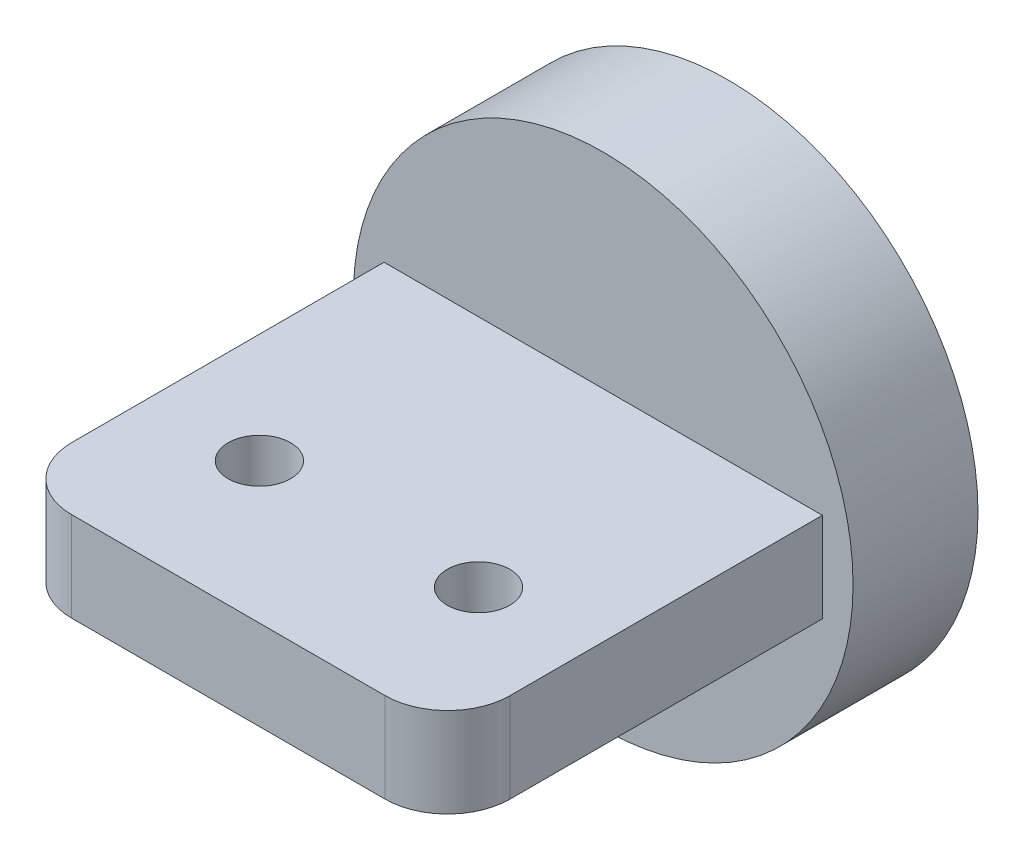
ISO-10303-21;
HEADER;
FILE_DESCRIPTION(('STEP AP214'),'2;1');
FILE_NAME('part.step','',(''),(''),'','','');
FILE_SCHEMA(('AUTOMOTIVE_DESIGN { 1 0 10303 214 1 1 1 1 }'));
ENDSEC;
DATA;
#1=APPLICATION_CONTEXT('core data for automotive mechanical design processes');
#2=APPLICATION_PROTOCOL_DEFINITION('international standard','automotive_design',2000,#1);
#3=PRODUCT_CONTEXT('',#1,'mechanical');
#4=PRODUCT('Part','Part','',(#3));
#5=PRODUCT_RELATED_PRODUCT_CATEGORY('part','',(#4));
#6=PRODUCT_DEFINITION_FORMATION('','',#4);
#7=PRODUCT_DEFINITION_CONTEXT('part definition',#1,'design');
#8=PRODUCT_DEFINITION('design','',#6,#7);
#9=PRODUCT_DEFINITION_SHAPE('','',#8);
#10=(LENGTH_UNIT() NAMED_UNIT(*) SI_UNIT(.MILLI.,.METRE.));
#11=(NAMED_UNIT(*) PLANE_ANGLE_UNIT() SI_UNIT($,.RADIAN.));
#12=(NAMED_UNIT(*) SI_UNIT($,.STERADIAN.) SOLID_ANGLE_UNIT());
#13=UNCERTAINTY_MEASURE_WITH_UNIT(LENGTH_MEASURE(1.E-05),#10,'distance_accuracy_value','');
#14=(GEOMETRIC_REPRESENTATION_CONTEXT(3) GLOBAL_UNCERTAINTY_ASSIGNED_CONTEXT((#13)) GLOBAL_UNIT_ASSIGNED_CONTEXT((#10,
#11,#12)) REPRESENTATION_CONTEXT('',''));
#15=CARTESIAN_POINT('',(0.,0.,0.));
#16=DIRECTION('',(0.,0.,1.));
#17=DIRECTION('',(1.,0.,0.));
#18=AXIS2_PLACEMENT_3D('',#15,#16,#17);
#19=CARTESIAN_POINT('',(0.,0.,10.));
#20=DIRECTION('',(0.,0.,-1.));
#21=DIRECTION('',(-1.,0.,0.));
#22=AXIS2_PLACEMENT_3D('',#19,#20,#21);
#23=CYLINDRICAL_SURFACE('',#22,20.);
#24=CARTESIAN_POINT('',(0.,0.,10.));
#25=DIRECTION('',(0.,0.,1.));
#26=DIRECTION('',(1.,0.,0.));
#27=AXIS2_PLACEMENT_3D('',#24,#25,#26);
#28=CIRCLE('',#27,20.);
#29=CARTESIAN_POINT('',(20.,0.,10.));
#30=VERTEX_POINT('',#29);
#31=EDGE_CURVE('E139',#30,#30,#28,.T.);
#32=ORIENTED_EDGE('',*,*,#31,.F.);
#33=EDGE_LOOP('',(#32));
#34=FACE_BOUND('',#33,.T.);
#35=CARTESIAN_POINT('',(0.,0.,0.));
#36=DIRECTION('',(0.,0.,1.));
#37=DIRECTION('',(1.,0.,0.));
#38=AXIS2_PLACEMENT_3D('',#35,#36,#37);
#39=CIRCLE('',#38,20.);
#40=CARTESIAN_POINT('',(20.,0.,0.));
#41=VERTEX_POINT('',#40);
#42=EDGE_CURVE('E138',#41,#41,#39,.T.);
#43=ORIENTED_EDGE('',*,*,#42,.T.);
#44=EDGE_LOOP('',(#43));
#45=FACE_BOUND('',#44,.T.);
#46=ADVANCED_FACE('F38',(#34,#45),#23,.T.);
#47=CARTESIAN_POINT('',(0.,0.,10.));
#48=DIRECTION('',(0.,0.,1.));
#49=DIRECTION('',(1.,0.,0.));
#50=AXIS2_PLACEMENT_3D('',#47,#48,#49);
#51=PLANE('',#50);
#52=DIRECTION('',(0.,1.,0.));
#53=VECTOR('',#52,1.);
#54=CARTESIAN_POINT('',(17.5413272845998,3.58799876275901,10.));
#55=LINE('',#54,#53);
#56=CARTESIAN_POINT('',(17.5413272845998,-3.58799876275901,10.));
#57=VERTEX_POINT('',#56);
#58=CARTESIAN_POINT('',(17.5413272845998,3.58799876275901,10.));
#59=VERTEX_POINT('',#58);
#60=EDGE_CURVE('E121',#57,#59,#55,.T.);
#61=ORIENTED_EDGE('',*,*,#60,.F.);
#62=DIRECTION('',(1.,0.,0.));
#63=VECTOR('',#62,1.);
#64=CARTESIAN_POINT('',(-17.5413272845998,-3.58799876275901,10.));
#65=LINE('',#64,#63);
#66=CARTESIAN_POINT('',(-17.5413272845998,-3.58799876275901,10.));
#67=VERTEX_POINT('',#66);
#68=EDGE_CURVE('E115',#67,#57,#65,.T.);
#69=ORIENTED_EDGE('',*,*,#68,.F.);
#70=DIRECTION('',(0.,-1.,0.));
#71=VECTOR('',#70,1.);
#72=CARTESIAN_POINT('',(-17.5413272845998,3.58799876275901,10.));
#73=LINE('',#72,#71);
#74=CARTESIAN_POINT('',(-17.5413272845998,3.58799876275901,10.));
#75=VERTEX_POINT('',#74);
#76=EDGE_CURVE('E97',#75,#67,#73,.T.);
#77=ORIENTED_EDGE('',*,*,#76,.F.);
#78=DIRECTION('',(-1.,0.,0.));
#79=VECTOR('',#78,1.);
#80=CARTESIAN_POINT('',(-17.5413272845998,3.58799876275901,10.));
#81=LINE('',#80,#79);
#82=EDGE_CURVE('E112',#59,#75,#81,.T.);
#83=ORIENTED_EDGE('',*,*,#82,.F.);
#84=EDGE_LOOP('',(#61,#69,#77,#83));
#85=FACE_BOUND('',#84,.T.);
#86=ORIENTED_EDGE('',*,*,#31,.T.);
#87=EDGE_LOOP('',(#86));
#88=FACE_BOUND('',#87,.T.);
#89=ADVANCED_FACE('F110',(#85,#88),#51,.T.);
#90=CARTESIAN_POINT('',(0.,0.,0.));
#91=DIRECTION('',(0.,0.,1.));
#92=DIRECTION('',(1.,0.,0.));
#93=AXIS2_PLACEMENT_3D('',#90,#91,#92);
#94=PLANE('',#93);
#95=CARTESIAN_POINT('',(0.,0.,0.));
#96=DIRECTION('',(0.,0.,-1.));
#97=DIRECTION('',(-1.,0.,0.));
#98=AXIS2_PLACEMENT_3D('',#95,#96,#97);
#99=CIRCLE('',#98,10.);
#100=CARTESIAN_POINT('',(-10.,0.,0.));
#101=VERTEX_POINT('',#100);
#102=EDGE_CURVE('E184',#101,#101,#99,.T.);
#103=ORIENTED_EDGE('',*,*,#102,.F.);
#104=EDGE_LOOP('',(#103));
#105=FACE_BOUND('',#104,.T.);
#106=ORIENTED_EDGE('',*,*,#42,.F.);
#107=EDGE_LOOP('',(#106));
#108=FACE_BOUND('',#107,.T.);
#109=ADVANCED_FACE('F216',(#105,#108),#94,.F.);
#110=CARTESIAN_POINT('',(17.5413272845998,3.58799876275901,40.));
#111=DIRECTION('',(-1.,0.,0.));
#112=DIRECTION('',(0.,0.,1.));
#113=AXIS2_PLACEMENT_3D('',#110,#111,#112);
#114=PLANE('',#113);
#115=DIRECTION('',(0.,0.,-1.));
#116=VECTOR('',#115,1.);
#117=CARTESIAN_POINT('',(17.5413272845998,3.58799876275901,40.));
#118=LINE('',#117,#116);
#119=CARTESIAN_POINT('',(17.5413272845998,3.58799876275901,35.));
#120=VERTEX_POINT('',#119);
#121=EDGE_CURVE('E103',#120,#59,#118,.T.);
#122=ORIENTED_EDGE('',*,*,#121,.F.);
#123=DIRECTION('',(0.,1.,0.));
#124=VECTOR('',#123,1.);
#125=CARTESIAN_POINT('',(17.5413272845998,-3.58799876275901,35.));
#126=LINE('',#125,#124);
#127=CARTESIAN_POINT('',(17.5413272845998,-3.58799876275901,35.));
#128=VERTEX_POINT('',#127);
#129=EDGE_CURVE('E64',#120,#128,#126,.F.);
#130=ORIENTED_EDGE('',*,*,#129,.T.);
#131=DIRECTION('',(0.,0.,-1.));
#132=VECTOR('',#131,1.);
#133=CARTESIAN_POINT('',(17.5413272845998,-3.58799876275901,40.));
#134=LINE('',#133,#132);
#135=EDGE_CURVE('E130',#128,#57,#134,.T.);
#136=ORIENTED_EDGE('',*,*,#135,.T.);
#137=ORIENTED_EDGE('',*,*,#60,.T.);
#138=EDGE_LOOP('',(#122,#130,#136,#137));
#139=FACE_BOUND('',#138,.T.);
#140=ADVANCED_FACE('F198',(#139),#114,.F.);
#141=CARTESIAN_POINT('',(-17.5413272845998,3.58799876275901,40.));
#142=DIRECTION('',(0.,-1.,0.));
#143=DIRECTION('',(0.,0.,-1.));
#144=AXIS2_PLACEMENT_3D('',#141,#142,#143);
#145=PLANE('',#144);
#146=CARTESIAN_POINT('',(-8.7706636422999,3.58799876275901,28.75));
#147=DIRECTION('',(0.,1.,0.));
#148=DIRECTION('',(0.,0.,1.));
#149=AXIS2_PLACEMENT_3D('',#146,#147,#148);
#150=CIRCLE('',#149,2.5);
#151=CARTESIAN_POINT('',(-8.7706636422999,3.58799876275901,31.25));
#152=VERTEX_POINT('',#151);
#153=EDGE_CURVE('E168',#152,#152,#150,.T.);
#154=ORIENTED_EDGE('',*,*,#153,.F.);
#155=EDGE_LOOP('',(#154));
#156=FACE_BOUND('',#155,.T.);
#157=CARTESIAN_POINT('',(8.7706636422999,3.58799876275901,28.75));
#158=DIRECTION('',(0.,1.,0.));
#159=DIRECTION('',(0.,0.,-1.));
#160=AXIS2_PLACEMENT_3D('',#157,#158,#159);
#161=CIRCLE('',#160,2.5);
#162=CARTESIAN_POINT('',(8.7706636422999,3.58799876275901,26.25));
#163=VERTEX_POINT('',#162);
#164=EDGE_CURVE('E175',#163,#163,#161,.T.);
#165=ORIENTED_EDGE('',*,*,#164,.F.);
#166=EDGE_LOOP('',(#165));
#167=FACE_BOUND('',#166,.T.);
#168=DIRECTION('',(-1.,0.,0.));
#169=VECTOR('',#168,1.);
#170=CARTESIAN_POINT('',(-17.5413272845998,3.58799876275901,40.));
#171=LINE('',#170,#169);
#172=CARTESIAN_POINT('',(12.5413272845998,3.58799876275901,40.));
#173=VERTEX_POINT('',#172);
#174=CARTESIAN_POINT('',(-12.5413272845998,3.58799876275901,40.));
#175=VERTEX_POINT('',#174);
#176=EDGE_CURVE('E129',#173,#175,#171,.T.);
#177=ORIENTED_EDGE('',*,*,#176,.F.);
#178=CARTESIAN_POINT('',(12.5413272845998,3.58799876275901,35.));
#179=DIRECTION('',(0.,-1.,0.));
#180=DIRECTION('',(0.,0.,-1.));
#181=AXIS2_PLACEMENT_3D('',#178,#179,#180);
#182=CIRCLE('',#181,5.);
#183=EDGE_CURVE('E157',#173,#120,#182,.F.);
#184=ORIENTED_EDGE('',*,*,#183,.T.);
#185=ORIENTED_EDGE('',*,*,#121,.T.);
#186=ORIENTED_EDGE('',*,*,#82,.T.);
#187=DIRECTION('',(0.,0.,-1.));
#188=VECTOR('',#187,1.);
#189=CARTESIAN_POINT('',(-17.5413272845998,3.58799876275901,40.));
#190=LINE('',#189,#188);
#191=CARTESIAN_POINT('',(-17.5413272845998,3.58799876275901,35.));
#192=VERTEX_POINT('',#191);
#193=EDGE_CURVE('E94',#192,#75,#190,.T.);
#194=ORIENTED_EDGE('',*,*,#193,.F.);
#195=CARTESIAN_POINT('',(-12.5413272845998,3.58799876275901,35.));
#196=DIRECTION('',(0.,-1.,0.));
#197=DIRECTION('',(0.,0.,-1.));
#198=AXIS2_PLACEMENT_3D('',#195,#196,#197);
#199=CIRCLE('',#198,5.);
#200=EDGE_CURVE('E154',#192,#175,#199,.F.);
#201=ORIENTED_EDGE('',*,*,#200,.T.);
#202=EDGE_LOOP('',(#177,#184,#185,#186,#194,#201));
#203=FACE_BOUND('',#202,.T.);
#204=ADVANCED_FACE('F119',(#156,#167,#203),#145,.F.);
#205=CARTESIAN_POINT('',(-17.5413272845998,3.58799876275901,40.));
#206=DIRECTION('',(1.,0.,0.));
#207=DIRECTION('',(0.,0.,-1.));
#208=AXIS2_PLACEMENT_3D('',#205,#206,#207);
#209=PLANE('',#208);
#210=DIRECTION('',(0.,0.,-1.));
#211=VECTOR('',#210,1.);
#212=CARTESIAN_POINT('',(-17.5413272845998,-3.58799876275901,40.));
#213=LINE('',#212,#211);
#214=CARTESIAN_POINT('',(-17.5413272845998,-3.58799876275901,35.));
#215=VERTEX_POINT('',#214);
#216=EDGE_CURVE('E104',#215,#67,#213,.T.);
#217=ORIENTED_EDGE('',*,*,#216,.F.);
#218=DIRECTION('',(0.,-1.,0.));
#219=VECTOR('',#218,1.);
#220=CARTESIAN_POINT('',(-17.5413272845998,3.58799876275901,35.));
#221=LINE('',#220,#219);
#222=EDGE_CURVE('E11',#215,#192,#221,.F.);
#223=ORIENTED_EDGE('',*,*,#222,.T.);
#224=ORIENTED_EDGE('',*,*,#193,.T.);
#225=ORIENTED_EDGE('',*,*,#76,.T.);
#226=EDGE_LOOP('',(#217,#223,#224,#225));
#227=FACE_BOUND('',#226,.T.);
#228=ADVANCED_FACE('F96',(#227),#209,.F.);
#229=CARTESIAN_POINT('',(-17.5413272845998,-3.58799876275901,40.));
#230=DIRECTION('',(0.,1.,0.));
#231=DIRECTION('',(0.,0.,1.));
#232=AXIS2_PLACEMENT_3D('',#229,#230,#231);
#233=PLANE('',#232);
#234=CARTESIAN_POINT('',(-8.7706636422999,-3.58799876275901,28.75));
#235=DIRECTION('',(0.,1.,0.));
#236=DIRECTION('',(0.,0.,1.));
#237=AXIS2_PLACEMENT_3D('',#234,#235,#236);
#238=CIRCLE('',#237,2.5);
#239=CARTESIAN_POINT('',(-8.7706636422999,-3.58799876275901,31.25));
#240=VERTEX_POINT('',#239);
#241=EDGE_CURVE('E42',#240,#240,#238,.T.);
#242=ORIENTED_EDGE('',*,*,#241,.T.);
#243=EDGE_LOOP('',(#242));
#244=FACE_BOUND('',#243,.T.);
#245=CARTESIAN_POINT('',(8.7706636422999,-3.58799876275901,28.75));
#246=DIRECTION('',(0.,1.,0.));
#247=DIRECTION('',(0.,0.,1.));
#248=AXIS2_PLACEMENT_3D('',#245,#246,#247);
#249=CIRCLE('',#248,2.5);
#250=CARTESIAN_POINT('',(8.7706636422999,-3.58799876275901,31.25));
#251=VERTEX_POINT('',#250);
#252=EDGE_CURVE('E165',#251,#251,#249,.T.);
#253=ORIENTED_EDGE('',*,*,#252,.T.);
#254=EDGE_LOOP('',(#253));
#255=FACE_BOUND('',#254,.T.);
#256=ORIENTED_EDGE('',*,*,#135,.F.);
#257=CARTESIAN_POINT('',(12.5413272845998,-3.58799876275901,35.));
#258=DIRECTION('',(0.,1.,0.));
#259=DIRECTION('',(0.,0.,1.));
#260=AXIS2_PLACEMENT_3D('',#257,#258,#259);
#261=CIRCLE('',#260,5.);
#262=CARTESIAN_POINT('',(12.5413272845998,-3.58799876275901,40.));
#263=VERTEX_POINT('',#262);
#264=EDGE_CURVE('E48',#128,#263,#261,.F.);
#265=ORIENTED_EDGE('',*,*,#264,.T.);
#266=DIRECTION('',(1.,0.,0.));
#267=VECTOR('',#266,1.);
#268=CARTESIAN_POINT('',(-17.5413272845998,-3.58799876275901,40.));
#269=LINE('',#268,#267);
#270=CARTESIAN_POINT('',(-12.5413272845998,-3.58799876275901,40.));
#271=VERTEX_POINT('',#270);
#272=EDGE_CURVE('E133',#271,#263,#269,.T.);
#273=ORIENTED_EDGE('',*,*,#272,.F.);
#274=CARTESIAN_POINT('',(-12.5413272845998,-3.58799876275901,35.));
#275=DIRECTION('',(0.,1.,0.));
#276=DIRECTION('',(0.,0.,1.));
#277=AXIS2_PLACEMENT_3D('',#274,#275,#276);
#278=CIRCLE('',#277,5.);
#279=EDGE_CURVE('E56',#271,#215,#278,.F.);
#280=ORIENTED_EDGE('',*,*,#279,.T.);
#281=ORIENTED_EDGE('',*,*,#216,.T.);
#282=ORIENTED_EDGE('',*,*,#68,.T.);
#283=EDGE_LOOP('',(#256,#265,#273,#280,#281,#282));
#284=FACE_BOUND('',#283,.T.);
#285=ADVANCED_FACE('F199',(#244,#255,#284),#233,.F.);
#286=CARTESIAN_POINT('',(0.,0.,40.));
#287=DIRECTION('',(0.,0.,1.));
#288=DIRECTION('',(1.,0.,0.));
#289=AXIS2_PLACEMENT_3D('',#286,#287,#288);
#290=PLANE('',#289);
#291=ORIENTED_EDGE('',*,*,#272,.T.);
#292=DIRECTION('',(0.,1.,0.));
#293=VECTOR('',#292,1.);
#294=CARTESIAN_POINT('',(12.5413272845998,3.58799876275901,40.));
#295=LINE('',#294,#293);
#296=EDGE_CURVE('E150',#263,#173,#295,.T.);
#297=ORIENTED_EDGE('',*,*,#296,.T.);
#298=ORIENTED_EDGE('',*,*,#176,.T.);
#299=DIRECTION('',(0.,-1.,0.));
#300=VECTOR('',#299,1.);
#301=CARTESIAN_POINT('',(-12.5413272845998,-3.58799876275901,40.));
#302=LINE('',#301,#300);
#303=EDGE_CURVE('E143',#175,#271,#302,.T.);
#304=ORIENTED_EDGE('',*,*,#303,.T.);
#305=EDGE_LOOP('',(#291,#297,#298,#304));
#306=FACE_BOUND('',#305,.T.);
#307=ADVANCED_FACE('F193',(#306),#290,.T.);
#308=CARTESIAN_POINT('',(12.5413272845998,0.,35.));
#309=DIRECTION('',(0.,-1.,0.));
#310=DIRECTION('',(0.,0.,-1.));
#311=AXIS2_PLACEMENT_3D('',#308,#309,#310);
#312=CYLINDRICAL_SURFACE('',#311,5.);
#313=ORIENTED_EDGE('',*,*,#264,.F.);
#314=ORIENTED_EDGE('',*,*,#129,.F.);
#315=ORIENTED_EDGE('',*,*,#183,.F.);
#316=ORIENTED_EDGE('',*,*,#296,.F.);
#317=EDGE_LOOP('',(#313,#314,#315,#316));
#318=FACE_BOUND('',#317,.T.);
#319=ADVANCED_FACE('F197',(#318),#312,.T.);
#320=CARTESIAN_POINT('',(-12.5413272845998,0.,35.));
#321=DIRECTION('',(0.,1.,0.));
#322=DIRECTION('',(0.,0.,1.));
#323=AXIS2_PLACEMENT_3D('',#320,#321,#322);
#324=CYLINDRICAL_SURFACE('',#323,5.);
#325=ORIENTED_EDGE('',*,*,#200,.F.);
#326=ORIENTED_EDGE('',*,*,#222,.F.);
#327=ORIENTED_EDGE('',*,*,#279,.F.);
#328=ORIENTED_EDGE('',*,*,#303,.F.);
#329=EDGE_LOOP('',(#325,#326,#327,#328));
#330=FACE_BOUND('',#329,.T.);
#331=ADVANCED_FACE('F40',(#330),#324,.T.);
#332=CARTESIAN_POINT('',(8.7706636422999,-26.412001237241,28.75));
#333=DIRECTION('',(0.,1.,0.));
#334=DIRECTION('',(0.,0.,1.));
#335=AXIS2_PLACEMENT_3D('',#332,#333,#334);
#336=CYLINDRICAL_SURFACE('',#335,2.5);
#337=ORIENTED_EDGE('',*,*,#164,.T.);
#338=EDGE_LOOP('',(#337));
#339=FACE_BOUND('',#338,.T.);
#340=ORIENTED_EDGE('',*,*,#252,.F.);
#341=EDGE_LOOP('',(#340));
#342=FACE_BOUND('',#341,.T.);
#343=ADVANCED_FACE('F202',(#339,#342),#336,.F.);
#344=CARTESIAN_POINT('',(-8.7706636422999,-26.412001237241,28.75));
#345=DIRECTION('',(0.,1.,0.));
#346=DIRECTION('',(0.,0.,1.));
#347=AXIS2_PLACEMENT_3D('',#344,#345,#346);
#348=CYLINDRICAL_SURFACE('',#347,2.5);
#349=ORIENTED_EDGE('',*,*,#153,.T.);
#350=EDGE_LOOP('',(#349));
#351=FACE_BOUND('',#350,.T.);
#352=ORIENTED_EDGE('',*,*,#241,.F.);
#353=EDGE_LOOP('',(#352));
#354=FACE_BOUND('',#353,.T.);
#355=ADVANCED_FACE('F207',(#351,#354),#348,.F.);
#356=CARTESIAN_POINT('',(0.,0.,5.));
#357=DIRECTION('',(0.,0.,-1.));
#358=DIRECTION('',(-1.,0.,0.));
#359=AXIS2_PLACEMENT_3D('',#356,#357,#358);
#360=CYLINDRICAL_SURFACE('',#359,10.);
#361=CARTESIAN_POINT('',(0.,0.,5.));
#362=DIRECTION('',(0.,0.,-1.));
#363=DIRECTION('',(-1.,0.,0.));
#364=AXIS2_PLACEMENT_3D('',#361,#362,#363);
#365=CIRCLE('',#364,10.);
#366=CARTESIAN_POINT('',(-10.,0.,5.));
#367=VERTEX_POINT('',#366);
#368=EDGE_CURVE('E181',#367,#367,#365,.T.);
#369=ORIENTED_EDGE('',*,*,#368,.F.);
#370=EDGE_LOOP('',(#369));
#371=FACE_BOUND('',#370,.T.);
#372=ORIENTED_EDGE('',*,*,#102,.T.);
#373=EDGE_LOOP('',(#372));
#374=FACE_BOUND('',#373,.T.);
#375=ADVANCED_FACE('F238',(#371,#374),#360,.F.);
#376=CARTESIAN_POINT('',(0.,0.,5.));
#377=DIRECTION('',(0.,0.,-1.));
#378=DIRECTION('',(-1.,0.,0.));
#379=AXIS2_PLACEMENT_3D('',#376,#377,#378);
#380=PLANE('',#379);
#381=ORIENTED_EDGE('',*,*,#368,.T.);
#382=EDGE_LOOP('',(#381));
#383=FACE_BOUND('',#382,.T.);
#384=ADVANCED_FACE('F241',(#383),#380,.T.);
#385=CLOSED_SHELL('',(#46,#89,#109,#140,#204,#228,#285,#307,#319,#331,#343,#355,#375,#384));
#386=MANIFOLD_SOLID_BREP('B2',#385);
#387=ADVANCED_BREP_SHAPE_REPRESENTATION('',(#18,#386),#14);
#388=SHAPE_DEFINITION_REPRESENTATION(#9,#387);
ENDSEC;
END-ISO-10303-21;
